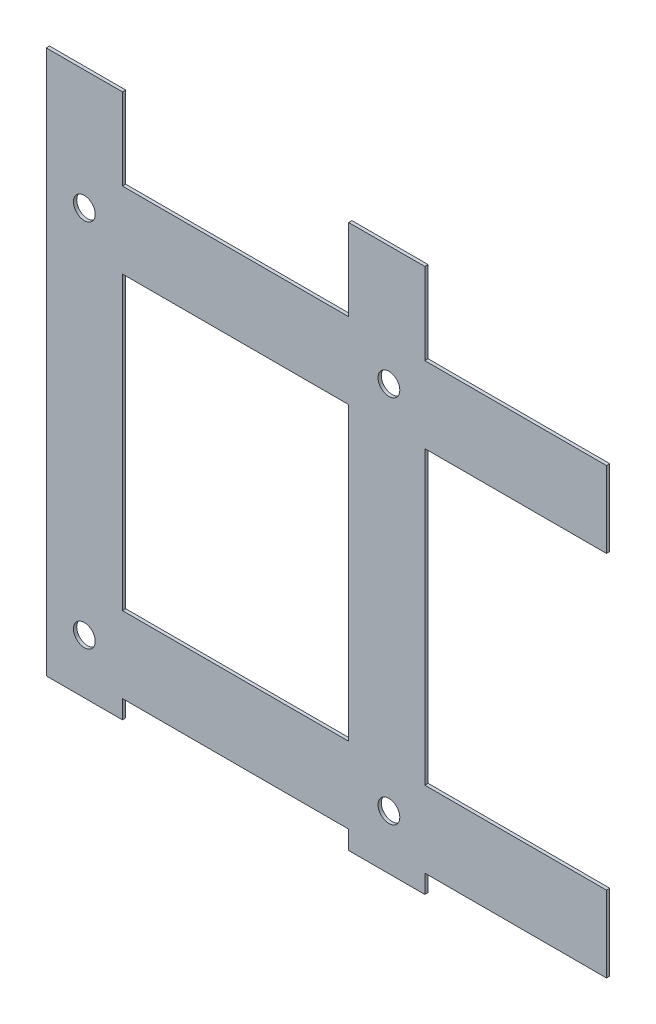
ISO-10303-21;
HEADER;
FILE_DESCRIPTION(('STEP AP214'),'2;1');
FILE_NAME('part.step','',(''),(''),'','','');
FILE_SCHEMA(('AUTOMOTIVE_DESIGN { 1 0 10303 214 1 1 1 1 }'));
ENDSEC;
DATA;
#1=APPLICATION_CONTEXT('core data for automotive mechanical design processes');
#2=APPLICATION_PROTOCOL_DEFINITION('international standard','automotive_design',2000,#1);
#3=PRODUCT_CONTEXT('',#1,'mechanical');
#4=PRODUCT('Part','Part','',(#3));
#5=PRODUCT_RELATED_PRODUCT_CATEGORY('part','',(#4));
#6=PRODUCT_DEFINITION_FORMATION('','',#4);
#7=PRODUCT_DEFINITION_CONTEXT('part definition',#1,'design');
#8=PRODUCT_DEFINITION('design','',#6,#7);
#9=PRODUCT_DEFINITION_SHAPE('','',#8);
#10=(LENGTH_UNIT() NAMED_UNIT(*) SI_UNIT(.MILLI.,.METRE.));
#11=(NAMED_UNIT(*) PLANE_ANGLE_UNIT() SI_UNIT($,.RADIAN.));
#12=(NAMED_UNIT(*) SI_UNIT($,.STERADIAN.) SOLID_ANGLE_UNIT());
#13=UNCERTAINTY_MEASURE_WITH_UNIT(LENGTH_MEASURE(1.E-05),#10,'distance_accuracy_value','');
#14=(GEOMETRIC_REPRESENTATION_CONTEXT(3) GLOBAL_UNCERTAINTY_ASSIGNED_CONTEXT((#13)) GLOBAL_UNIT_ASSIGNED_CONTEXT((#10,
#11,#12)) REPRESENTATION_CONTEXT('',''));
#15=CARTESIAN_POINT('',(0.,0.,0.));
#16=DIRECTION('',(0.,0.,1.));
#17=DIRECTION('',(1.,0.,0.));
#18=AXIS2_PLACEMENT_3D('',#15,#16,#17);
#19=CARTESIAN_POINT('',(-57.3540133748365,28.7716502738454,-3.));
#20=DIRECTION('',(0.,1.,0.));
#21=DIRECTION('',(0.,0.,1.));
#22=AXIS2_PLACEMENT_3D('',#19,#20,#21);
#23=PLANE('',#22);
#24=DIRECTION('',(-1.,0.,0.));
#25=VECTOR('',#24,1.);
#26=CARTESIAN_POINT('',(-57.3540133748365,28.7716502738454,0.));
#27=LINE('',#26,#25);
#28=CARTESIAN_POINT('',(12.6459866251635,28.7716502738454,0.));
#29=VERTEX_POINT('',#28);
#30=CARTESIAN_POINT('',(-57.3540133748365,28.7716502738454,0.));
#31=VERTEX_POINT('',#30);
#32=EDGE_CURVE('E239',#29,#31,#27,.T.);
#33=ORIENTED_EDGE('',*,*,#32,.F.);
#34=DIRECTION('',(0.,0.,1.));
#35=VECTOR('',#34,1.);
#36=CARTESIAN_POINT('',(12.6459866251635,28.7716502738454,-3.));
#37=LINE('',#36,#35);
#38=CARTESIAN_POINT('',(12.6459866251635,28.7716502738454,-3.));
#39=VERTEX_POINT('',#38);
#40=EDGE_CURVE('E11',#39,#29,#37,.T.);
#41=ORIENTED_EDGE('',*,*,#40,.F.);
#42=DIRECTION('',(-1.,0.,0.));
#43=VECTOR('',#42,1.);
#44=CARTESIAN_POINT('',(-57.3540133748365,28.7716502738454,-3.));
#45=LINE('',#44,#43);
#46=CARTESIAN_POINT('',(-57.3540133748365,28.7716502738454,-3.));
#47=VERTEX_POINT('',#46);
#48=EDGE_CURVE('E243',#39,#47,#45,.T.);
#49=ORIENTED_EDGE('',*,*,#48,.T.);
#50=DIRECTION('',(0.,0.,1.));
#51=VECTOR('',#50,1.);
#52=CARTESIAN_POINT('',(-57.3540133748365,28.7716502738454,-3.));
#53=LINE('',#52,#51);
#54=EDGE_CURVE('E44',#47,#31,#53,.T.);
#55=ORIENTED_EDGE('',*,*,#54,.T.);
#56=EDGE_LOOP('',(#33,#41,#49,#55));
#57=FACE_BOUND('',#56,.T.);
#58=ADVANCED_FACE('F41',(#57),#23,.T.);
#59=CARTESIAN_POINT('',(12.6459866251635,28.7716502738454,-3.));
#60=DIRECTION('',(1.,0.,0.));
#61=DIRECTION('',(0.,0.,-1.));
#62=AXIS2_PLACEMENT_3D('',#59,#60,#61);
#63=PLANE('',#62);
#64=DIRECTION('',(0.,1.,0.));
#65=VECTOR('',#64,1.);
#66=CARTESIAN_POINT('',(12.6459866251635,28.7716502738454,0.));
#67=LINE('',#66,#65);
#68=CARTESIAN_POINT('',(12.6459866251635,-46.2283497261546,0.));
#69=VERTEX_POINT('',#68);
#70=EDGE_CURVE('E247',#69,#29,#67,.T.);
#71=ORIENTED_EDGE('',*,*,#70,.F.);
#72=DIRECTION('',(0.,0.,1.));
#73=VECTOR('',#72,1.);
#74=CARTESIAN_POINT('',(12.6459866251635,-46.2283497261546,-3.));
#75=LINE('',#74,#73);
#76=CARTESIAN_POINT('',(12.6459866251635,-46.2283497261546,-3.));
#77=VERTEX_POINT('',#76);
#78=EDGE_CURVE('E49',#77,#69,#75,.T.);
#79=ORIENTED_EDGE('',*,*,#78,.F.);
#80=DIRECTION('',(0.,1.,0.));
#81=VECTOR('',#80,1.);
#82=CARTESIAN_POINT('',(12.6459866251635,28.7716502738454,-3.));
#83=LINE('',#82,#81);
#84=EDGE_CURVE('E301',#77,#39,#83,.T.);
#85=ORIENTED_EDGE('',*,*,#84,.T.);
#86=ORIENTED_EDGE('',*,*,#40,.T.);
#87=EDGE_LOOP('',(#71,#79,#85,#86));
#88=FACE_BOUND('',#87,.T.);
#89=ADVANCED_FACE('F408',(#88),#63,.T.);
#90=CARTESIAN_POINT('',(12.6459866251635,-46.2283497261546,-3.));
#91=DIRECTION('',(0.,1.,0.));
#92=DIRECTION('',(-1.,0.,0.));
#93=AXIS2_PLACEMENT_3D('',#90,#91,#92);
#94=PLANE('',#93);
#95=DIRECTION('',(-1.,0.,0.));
#96=VECTOR('',#95,1.);
#97=CARTESIAN_POINT('',(12.6459866251635,-46.2283497261546,0.));
#98=LINE('',#97,#96);
#99=CARTESIAN_POINT('',(220.645986625163,-46.2283497261546,0.));
#100=VERTEX_POINT('',#99);
#101=EDGE_CURVE('E357',#100,#69,#98,.T.);
#102=ORIENTED_EDGE('',*,*,#101,.F.);
#103=DIRECTION('',(0.,0.,1.));
#104=VECTOR('',#103,1.);
#105=CARTESIAN_POINT('',(220.645986625163,-46.2283497261546,-3.));
#106=LINE('',#105,#104);
#107=CARTESIAN_POINT('',(220.645986625163,-46.2283497261546,-3.));
#108=VERTEX_POINT('',#107);
#109=EDGE_CURVE('E363',#108,#100,#106,.T.);
#110=ORIENTED_EDGE('',*,*,#109,.F.);
#111=DIRECTION('',(-1.,0.,0.));
#112=VECTOR('',#111,1.);
#113=CARTESIAN_POINT('',(12.6459866251635,-46.2283497261546,-3.));
#114=LINE('',#113,#112);
#115=EDGE_CURVE('E298',#108,#77,#114,.T.);
#116=ORIENTED_EDGE('',*,*,#115,.T.);
#117=ORIENTED_EDGE('',*,*,#78,.T.);
#118=EDGE_LOOP('',(#102,#110,#116,#117));
#119=FACE_BOUND('',#118,.T.);
#120=ADVANCED_FACE('F475',(#119),#94,.T.);
#121=CARTESIAN_POINT('',(220.645986625163,28.7716502738454,-3.));
#122=DIRECTION('',(-1.,0.,0.));
#123=DIRECTION('',(0.,0.,1.));
#124=AXIS2_PLACEMENT_3D('',#121,#122,#123);
#125=PLANE('',#124);
#126=DIRECTION('',(0.,-1.,0.));
#127=VECTOR('',#126,1.);
#128=CARTESIAN_POINT('',(220.645986625163,28.7716502738454,0.));
#129=LINE('',#128,#127);
#130=CARTESIAN_POINT('',(220.645986625163,28.7716502738454,0.));
#131=VERTEX_POINT('',#130);
#132=EDGE_CURVE('E354',#131,#100,#129,.T.);
#133=ORIENTED_EDGE('',*,*,#132,.F.);
#134=DIRECTION('',(0.,0.,1.));
#135=VECTOR('',#134,1.);
#136=CARTESIAN_POINT('',(220.645986625163,28.7716502738454,-3.));
#137=LINE('',#136,#135);
#138=CARTESIAN_POINT('',(220.645986625163,28.7716502738454,-3.));
#139=VERTEX_POINT('',#138);
#140=EDGE_CURVE('E365',#139,#131,#137,.T.);
#141=ORIENTED_EDGE('',*,*,#140,.F.);
#142=DIRECTION('',(0.,-1.,0.));
#143=VECTOR('',#142,1.);
#144=CARTESIAN_POINT('',(220.645986625163,28.7716502738454,-3.));
#145=LINE('',#144,#143);
#146=EDGE_CURVE('E295',#139,#108,#145,.T.);
#147=ORIENTED_EDGE('',*,*,#146,.T.);
#148=ORIENTED_EDGE('',*,*,#109,.T.);
#149=EDGE_LOOP('',(#133,#141,#147,#148));
#150=FACE_BOUND('',#149,.T.);
#151=ADVANCED_FACE('F473',(#150),#125,.T.);
#152=CARTESIAN_POINT('',(220.645986625163,28.7716502738454,-3.));
#153=DIRECTION('',(0.,1.,0.));
#154=DIRECTION('',(-1.,0.,0.));
#155=AXIS2_PLACEMENT_3D('',#152,#153,#154);
#156=PLANE('',#155);
#157=DIRECTION('',(-1.,0.,0.));
#158=VECTOR('',#157,1.);
#159=CARTESIAN_POINT('',(220.645986625163,28.7716502738454,0.));
#160=LINE('',#159,#158);
#161=CARTESIAN_POINT('',(290.645986625163,28.7716502738454,0.));
#162=VERTEX_POINT('',#161);
#163=EDGE_CURVE('E351',#162,#131,#160,.T.);
#164=ORIENTED_EDGE('',*,*,#163,.F.);
#165=DIRECTION('',(0.,0.,1.));
#166=VECTOR('',#165,1.);
#167=CARTESIAN_POINT('',(290.645986625163,28.7716502738454,-3.));
#168=LINE('',#167,#166);
#169=CARTESIAN_POINT('',(290.645986625163,28.7716502738454,-3.));
#170=VERTEX_POINT('',#169);
#171=EDGE_CURVE('E367',#170,#162,#168,.T.);
#172=ORIENTED_EDGE('',*,*,#171,.F.);
#173=DIRECTION('',(-1.,0.,0.));
#174=VECTOR('',#173,1.);
#175=CARTESIAN_POINT('',(220.645986625163,28.7716502738454,-3.));
#176=LINE('',#175,#174);
#177=EDGE_CURVE('E292',#170,#139,#176,.T.);
#178=ORIENTED_EDGE('',*,*,#177,.T.);
#179=ORIENTED_EDGE('',*,*,#140,.T.);
#180=EDGE_LOOP('',(#164,#172,#178,#179));
#181=FACE_BOUND('',#180,.T.);
#182=ADVANCED_FACE('F469',(#181),#156,.T.);
#183=CARTESIAN_POINT('',(290.645986625163,28.7716502738454,-3.));
#184=DIRECTION('',(1.,0.,0.));
#185=DIRECTION('',(0.,0.,-1.));
#186=AXIS2_PLACEMENT_3D('',#183,#184,#185);
#187=PLANE('',#186);
#188=DIRECTION('',(0.,1.,0.));
#189=VECTOR('',#188,1.);
#190=CARTESIAN_POINT('',(290.645986625163,28.7716502738454,0.));
#191=LINE('',#190,#189);
#192=CARTESIAN_POINT('',(290.645986625163,-46.2283497261546,0.));
#193=VERTEX_POINT('',#192);
#194=EDGE_CURVE('E348',#193,#162,#191,.T.);
#195=ORIENTED_EDGE('',*,*,#194,.F.);
#196=DIRECTION('',(0.,0.,1.));
#197=VECTOR('',#196,1.);
#198=CARTESIAN_POINT('',(290.645986625163,-46.2283497261546,-3.));
#199=LINE('',#198,#197);
#200=CARTESIAN_POINT('',(290.645986625163,-46.2283497261546,-3.));
#201=VERTEX_POINT('',#200);
#202=EDGE_CURVE('E369',#201,#193,#199,.T.);
#203=ORIENTED_EDGE('',*,*,#202,.F.);
#204=DIRECTION('',(0.,1.,0.));
#205=VECTOR('',#204,1.);
#206=CARTESIAN_POINT('',(290.645986625163,28.7716502738454,-3.));
#207=LINE('',#206,#205);
#208=EDGE_CURVE('E289',#201,#170,#207,.T.);
#209=ORIENTED_EDGE('',*,*,#208,.T.);
#210=ORIENTED_EDGE('',*,*,#171,.T.);
#211=EDGE_LOOP('',(#195,#203,#209,#210));
#212=FACE_BOUND('',#211,.T.);
#213=ADVANCED_FACE('F465',(#212),#187,.T.);
#214=CARTESIAN_POINT('',(290.645986625163,-46.2283497261546,-3.));
#215=DIRECTION('',(0.,1.,0.));
#216=DIRECTION('',(0.,0.,1.));
#217=AXIS2_PLACEMENT_3D('',#214,#215,#216);
#218=PLANE('',#217);
#219=DIRECTION('',(-1.,0.,0.));
#220=VECTOR('',#219,1.);
#221=CARTESIAN_POINT('',(290.645986625163,-46.2283497261546,0.));
#222=LINE('',#221,#220);
#223=CARTESIAN_POINT('',(457.645986625163,-46.2283497261546,0.));
#224=VERTEX_POINT('',#223);
#225=EDGE_CURVE('E345',#224,#193,#222,.T.);
#226=ORIENTED_EDGE('',*,*,#225,.F.);
#227=DIRECTION('',(0.,0.,1.));
#228=VECTOR('',#227,1.);
#229=CARTESIAN_POINT('',(457.645986625163,-46.2283497261546,-3.));
#230=LINE('',#229,#228);
#231=CARTESIAN_POINT('',(457.645986625163,-46.2283497261546,-3.));
#232=VERTEX_POINT('',#231);
#233=EDGE_CURVE('E371',#232,#224,#230,.T.);
#234=ORIENTED_EDGE('',*,*,#233,.F.);
#235=DIRECTION('',(-1.,0.,0.));
#236=VECTOR('',#235,1.);
#237=CARTESIAN_POINT('',(290.645986625163,-46.2283497261546,-3.));
#238=LINE('',#237,#236);
#239=EDGE_CURVE('E286',#232,#201,#238,.T.);
#240=ORIENTED_EDGE('',*,*,#239,.T.);
#241=ORIENTED_EDGE('',*,*,#202,.T.);
#242=EDGE_LOOP('',(#226,#234,#240,#241));
#243=FACE_BOUND('',#242,.T.);
#244=ADVANCED_FACE('F461',(#243),#218,.T.);
#245=CARTESIAN_POINT('',(457.645986625163,-46.2283497261546,-3.));
#246=DIRECTION('',(1.,0.,0.));
#247=DIRECTION('',(0.,0.,-1.));
#248=AXIS2_PLACEMENT_3D('',#245,#246,#247);
#249=PLANE('',#248);
#250=DIRECTION('',(0.,1.,0.));
#251=VECTOR('',#250,1.);
#252=CARTESIAN_POINT('',(457.645986625163,-46.2283497261546,0.));
#253=LINE('',#252,#251);
#254=CARTESIAN_POINT('',(457.645986625163,-116.228349726155,0.));
#255=VERTEX_POINT('',#254);
#256=EDGE_CURVE('E342',#255,#224,#253,.T.);
#257=ORIENTED_EDGE('',*,*,#256,.F.);
#258=DIRECTION('',(0.,0.,1.));
#259=VECTOR('',#258,1.);
#260=CARTESIAN_POINT('',(457.645986625163,-116.228349726155,-3.));
#261=LINE('',#260,#259);
#262=CARTESIAN_POINT('',(457.645986625163,-116.228349726155,-3.));
#263=VERTEX_POINT('',#262);
#264=EDGE_CURVE('E373',#263,#255,#261,.T.);
#265=ORIENTED_EDGE('',*,*,#264,.F.);
#266=DIRECTION('',(0.,1.,0.));
#267=VECTOR('',#266,1.);
#268=CARTESIAN_POINT('',(457.645986625163,-46.2283497261546,-3.));
#269=LINE('',#268,#267);
#270=EDGE_CURVE('E283',#263,#232,#269,.T.);
#271=ORIENTED_EDGE('',*,*,#270,.T.);
#272=ORIENTED_EDGE('',*,*,#233,.T.);
#273=EDGE_LOOP('',(#257,#265,#271,#272));
#274=FACE_BOUND('',#273,.T.);
#275=ADVANCED_FACE('F457',(#274),#249,.T.);
#276=CARTESIAN_POINT('',(290.645986625163,-116.228349726155,-3.));
#277=DIRECTION('',(0.,-1.,0.));
#278=DIRECTION('',(0.,0.,-1.));
#279=AXIS2_PLACEMENT_3D('',#276,#277,#278);
#280=PLANE('',#279);
#281=DIRECTION('',(1.,0.,0.));
#282=VECTOR('',#281,1.);
#283=CARTESIAN_POINT('',(290.645986625163,-116.228349726155,0.));
#284=LINE('',#283,#282);
#285=CARTESIAN_POINT('',(290.645986625163,-116.228349726155,0.));
#286=VERTEX_POINT('',#285);
#287=EDGE_CURVE('E339',#286,#255,#284,.T.);
#288=ORIENTED_EDGE('',*,*,#287,.F.);
#289=DIRECTION('',(0.,0.,1.));
#290=VECTOR('',#289,1.);
#291=CARTESIAN_POINT('',(290.645986625163,-116.228349726155,-3.));
#292=LINE('',#291,#290);
#293=CARTESIAN_POINT('',(290.645986625163,-116.228349726155,-3.));
#294=VERTEX_POINT('',#293);
#295=EDGE_CURVE('E375',#294,#286,#292,.T.);
#296=ORIENTED_EDGE('',*,*,#295,.F.);
#297=DIRECTION('',(1.,0.,0.));
#298=VECTOR('',#297,1.);
#299=CARTESIAN_POINT('',(290.645986625163,-116.228349726155,-3.));
#300=LINE('',#299,#298);
#301=EDGE_CURVE('E280',#294,#263,#300,.T.);
#302=ORIENTED_EDGE('',*,*,#301,.T.);
#303=ORIENTED_EDGE('',*,*,#264,.T.);
#304=EDGE_LOOP('',(#288,#296,#302,#303));
#305=FACE_BOUND('',#304,.T.);
#306=ADVANCED_FACE('F453',(#305),#280,.T.);
#307=CARTESIAN_POINT('',(290.645986625163,-116.228349726155,-3.));
#308=DIRECTION('',(1.,0.,0.));
#309=DIRECTION('',(0.,1.,0.));
#310=AXIS2_PLACEMENT_3D('',#307,#308,#309);
#311=PLANE('',#310);
#312=DIRECTION('',(0.,1.,0.));
#313=VECTOR('',#312,1.);
#314=CARTESIAN_POINT('',(290.645986625163,-116.228349726155,0.));
#315=LINE('',#314,#313);
#316=CARTESIAN_POINT('',(290.645986625163,-384.228349726155,0.));
#317=VERTEX_POINT('',#316);
#318=EDGE_CURVE('E336',#317,#286,#315,.T.);
#319=ORIENTED_EDGE('',*,*,#318,.F.);
#320=DIRECTION('',(0.,0.,1.));
#321=VECTOR('',#320,1.);
#322=CARTESIAN_POINT('',(290.645986625163,-384.228349726155,-3.));
#323=LINE('',#322,#321);
#324=CARTESIAN_POINT('',(290.645986625163,-384.228349726155,-3.));
#325=VERTEX_POINT('',#324);
#326=EDGE_CURVE('E377',#325,#317,#323,.T.);
#327=ORIENTED_EDGE('',*,*,#326,.F.);
#328=DIRECTION('',(0.,1.,0.));
#329=VECTOR('',#328,1.);
#330=CARTESIAN_POINT('',(290.645986625163,-116.228349726155,-3.));
#331=LINE('',#330,#329);
#332=EDGE_CURVE('E277',#325,#294,#331,.T.);
#333=ORIENTED_EDGE('',*,*,#332,.T.);
#334=ORIENTED_EDGE('',*,*,#295,.T.);
#335=EDGE_LOOP('',(#319,#327,#333,#334));
#336=FACE_BOUND('',#335,.T.);
#337=ADVANCED_FACE('F449',(#336),#311,.T.);
#338=CARTESIAN_POINT('',(290.645986625163,-384.228349726155,-3.));
#339=DIRECTION('',(0.,1.,0.));
#340=DIRECTION('',(0.,0.,1.));
#341=AXIS2_PLACEMENT_3D('',#338,#339,#340);
#342=PLANE('',#341);
#343=DIRECTION('',(-1.,0.,0.));
#344=VECTOR('',#343,1.);
#345=CARTESIAN_POINT('',(290.645986625163,-384.228349726155,0.));
#346=LINE('',#345,#344);
#347=CARTESIAN_POINT('',(457.645986625163,-384.228349726155,0.));
#348=VERTEX_POINT('',#347);
#349=EDGE_CURVE('E333',#348,#317,#346,.T.);
#350=ORIENTED_EDGE('',*,*,#349,.F.);
#351=DIRECTION('',(0.,0.,1.));
#352=VECTOR('',#351,1.);
#353=CARTESIAN_POINT('',(457.645986625163,-384.228349726155,-3.));
#354=LINE('',#353,#352);
#355=CARTESIAN_POINT('',(457.645986625163,-384.228349726155,-3.));
#356=VERTEX_POINT('',#355);
#357=EDGE_CURVE('E379',#356,#348,#354,.T.);
#358=ORIENTED_EDGE('',*,*,#357,.F.);
#359=DIRECTION('',(-1.,0.,0.));
#360=VECTOR('',#359,1.);
#361=CARTESIAN_POINT('',(290.645986625163,-384.228349726155,-3.));
#362=LINE('',#361,#360);
#363=EDGE_CURVE('E274',#356,#325,#362,.T.);
#364=ORIENTED_EDGE('',*,*,#363,.T.);
#365=ORIENTED_EDGE('',*,*,#326,.T.);
#366=EDGE_LOOP('',(#350,#358,#364,#365));
#367=FACE_BOUND('',#366,.T.);
#368=ADVANCED_FACE('F445',(#367),#342,.T.);
#369=CARTESIAN_POINT('',(457.645986625163,-384.228349726155,-3.));
#370=DIRECTION('',(1.,0.,0.));
#371=DIRECTION('',(0.,0.,-1.));
#372=AXIS2_PLACEMENT_3D('',#369,#370,#371);
#373=PLANE('',#372);
#374=DIRECTION('',(0.,1.,0.));
#375=VECTOR('',#374,1.);
#376=CARTESIAN_POINT('',(457.645986625163,-384.228349726155,0.));
#377=LINE('',#376,#375);
#378=CARTESIAN_POINT('',(457.645986625163,-454.228349726155,0.));
#379=VERTEX_POINT('',#378);
#380=EDGE_CURVE('E330',#379,#348,#377,.T.);
#381=ORIENTED_EDGE('',*,*,#380,.F.);
#382=DIRECTION('',(0.,0.,1.));
#383=VECTOR('',#382,1.);
#384=CARTESIAN_POINT('',(457.645986625163,-454.228349726155,-3.));
#385=LINE('',#384,#383);
#386=CARTESIAN_POINT('',(457.645986625163,-454.228349726155,-3.));
#387=VERTEX_POINT('',#386);
#388=EDGE_CURVE('E381',#387,#379,#385,.T.);
#389=ORIENTED_EDGE('',*,*,#388,.F.);
#390=DIRECTION('',(0.,1.,0.));
#391=VECTOR('',#390,1.);
#392=CARTESIAN_POINT('',(457.645986625163,-384.228349726155,-3.));
#393=LINE('',#392,#391);
#394=EDGE_CURVE('E271',#387,#356,#393,.T.);
#395=ORIENTED_EDGE('',*,*,#394,.T.);
#396=ORIENTED_EDGE('',*,*,#357,.T.);
#397=EDGE_LOOP('',(#381,#389,#395,#396));
#398=FACE_BOUND('',#397,.T.);
#399=ADVANCED_FACE('F441',(#398),#373,.T.);
#400=CARTESIAN_POINT('',(290.645986625163,-454.228349726155,-3.));
#401=DIRECTION('',(0.,-1.,0.));
#402=DIRECTION('',(1.,0.,0.));
#403=AXIS2_PLACEMENT_3D('',#400,#401,#402);
#404=PLANE('',#403);
#405=DIRECTION('',(1.,0.,0.));
#406=VECTOR('',#405,1.);
#407=CARTESIAN_POINT('',(290.645986625163,-454.228349726155,0.));
#408=LINE('',#407,#406);
#409=CARTESIAN_POINT('',(290.645986625163,-454.228349726155,0.));
#410=VERTEX_POINT('',#409);
#411=EDGE_CURVE('E327',#410,#379,#408,.T.);
#412=ORIENTED_EDGE('',*,*,#411,.F.);
#413=DIRECTION('',(0.,0.,1.));
#414=VECTOR('',#413,1.);
#415=CARTESIAN_POINT('',(290.645986625163,-454.228349726155,-3.));
#416=LINE('',#415,#414);
#417=CARTESIAN_POINT('',(290.645986625163,-454.228349726155,-3.));
#418=VERTEX_POINT('',#417);
#419=EDGE_CURVE('E383',#418,#410,#416,.T.);
#420=ORIENTED_EDGE('',*,*,#419,.F.);
#421=DIRECTION('',(1.,0.,0.));
#422=VECTOR('',#421,1.);
#423=CARTESIAN_POINT('',(290.645986625163,-454.228349726155,-3.));
#424=LINE('',#423,#422);
#425=EDGE_CURVE('E268',#418,#387,#424,.T.);
#426=ORIENTED_EDGE('',*,*,#425,.T.);
#427=ORIENTED_EDGE('',*,*,#388,.T.);
#428=EDGE_LOOP('',(#412,#420,#426,#427));
#429=FACE_BOUND('',#428,.T.);
#430=ADVANCED_FACE('F437',(#429),#404,.T.);
#431=CARTESIAN_POINT('',(290.645986625163,-454.228349726155,-3.));
#432=DIRECTION('',(1.,0.,0.));
#433=DIRECTION('',(0.,0.,-1.));
#434=AXIS2_PLACEMENT_3D('',#431,#432,#433);
#435=PLANE('',#434);
#436=DIRECTION('',(0.,1.,0.));
#437=VECTOR('',#436,1.);
#438=CARTESIAN_POINT('',(290.645986625163,-454.228349726155,0.));
#439=LINE('',#438,#437);
#440=CARTESIAN_POINT('',(290.645986625163,-471.228349726155,0.));
#441=VERTEX_POINT('',#440);
#442=EDGE_CURVE('E324',#441,#410,#439,.T.);
#443=ORIENTED_EDGE('',*,*,#442,.F.);
#444=DIRECTION('',(0.,0.,1.));
#445=VECTOR('',#444,1.);
#446=CARTESIAN_POINT('',(290.645986625163,-471.228349726155,-3.));
#447=LINE('',#446,#445);
#448=CARTESIAN_POINT('',(290.645986625163,-471.228349726155,-3.));
#449=VERTEX_POINT('',#448);
#450=EDGE_CURVE('E385',#449,#441,#447,.T.);
#451=ORIENTED_EDGE('',*,*,#450,.F.);
#452=DIRECTION('',(0.,1.,0.));
#453=VECTOR('',#452,1.);
#454=CARTESIAN_POINT('',(290.645986625163,-454.228349726155,-3.));
#455=LINE('',#454,#453);
#456=EDGE_CURVE('E265',#449,#418,#455,.T.);
#457=ORIENTED_EDGE('',*,*,#456,.T.);
#458=ORIENTED_EDGE('',*,*,#419,.T.);
#459=EDGE_LOOP('',(#443,#451,#457,#458));
#460=FACE_BOUND('',#459,.T.);
#461=ADVANCED_FACE('F433',(#460),#435,.T.);
#462=CARTESIAN_POINT('',(220.645986625163,-471.228349726155,-3.));
#463=DIRECTION('',(0.,-1.,0.));
#464=DIRECTION('',(0.,0.,-1.));
#465=AXIS2_PLACEMENT_3D('',#462,#463,#464);
#466=PLANE('',#465);
#467=DIRECTION('',(1.,0.,0.));
#468=VECTOR('',#467,1.);
#469=CARTESIAN_POINT('',(220.645986625163,-471.228349726155,0.));
#470=LINE('',#469,#468);
#471=CARTESIAN_POINT('',(220.645986625163,-471.228349726155,0.));
#472=VERTEX_POINT('',#471);
#473=EDGE_CURVE('E321',#472,#441,#470,.T.);
#474=ORIENTED_EDGE('',*,*,#473,.F.);
#475=DIRECTION('',(0.,0.,1.));
#476=VECTOR('',#475,1.);
#477=CARTESIAN_POINT('',(220.645986625163,-471.228349726155,-3.));
#478=LINE('',#477,#476);
#479=CARTESIAN_POINT('',(220.645986625163,-471.228349726155,-3.));
#480=VERTEX_POINT('',#479);
#481=EDGE_CURVE('E387',#480,#472,#478,.T.);
#482=ORIENTED_EDGE('',*,*,#481,.F.);
#483=DIRECTION('',(1.,0.,0.));
#484=VECTOR('',#483,1.);
#485=CARTESIAN_POINT('',(220.645986625163,-471.228349726155,-3.));
#486=LINE('',#485,#484);
#487=EDGE_CURVE('E262',#480,#449,#486,.T.);
#488=ORIENTED_EDGE('',*,*,#487,.T.);
#489=ORIENTED_EDGE('',*,*,#450,.T.);
#490=EDGE_LOOP('',(#474,#482,#488,#489));
#491=FACE_BOUND('',#490,.T.);
#492=ADVANCED_FACE('F429',(#491),#466,.T.);
#493=CARTESIAN_POINT('',(220.645986625163,-454.228349726155,-3.));
#494=DIRECTION('',(-1.,0.,0.));
#495=DIRECTION('',(0.,0.,1.));
#496=AXIS2_PLACEMENT_3D('',#493,#494,#495);
#497=PLANE('',#496);
#498=DIRECTION('',(0.,-1.,0.));
#499=VECTOR('',#498,1.);
#500=CARTESIAN_POINT('',(220.645986625163,-454.228349726155,0.));
#501=LINE('',#500,#499);
#502=CARTESIAN_POINT('',(220.645986625163,-454.228349726155,0.));
#503=VERTEX_POINT('',#502);
#504=EDGE_CURVE('E318',#503,#472,#501,.T.);
#505=ORIENTED_EDGE('',*,*,#504,.F.);
#506=DIRECTION('',(0.,0.,1.));
#507=VECTOR('',#506,1.);
#508=CARTESIAN_POINT('',(220.645986625163,-454.228349726155,-3.));
#509=LINE('',#508,#507);
#510=CARTESIAN_POINT('',(220.645986625163,-454.228349726155,-3.));
#511=VERTEX_POINT('',#510);
#512=EDGE_CURVE('E389',#511,#503,#509,.T.);
#513=ORIENTED_EDGE('',*,*,#512,.F.);
#514=DIRECTION('',(0.,-1.,0.));
#515=VECTOR('',#514,1.);
#516=CARTESIAN_POINT('',(220.645986625163,-454.228349726155,-3.));
#517=LINE('',#516,#515);
#518=EDGE_CURVE('E259',#511,#480,#517,.T.);
#519=ORIENTED_EDGE('',*,*,#518,.T.);
#520=ORIENTED_EDGE('',*,*,#481,.T.);
#521=EDGE_LOOP('',(#505,#513,#519,#520));
#522=FACE_BOUND('',#521,.T.);
#523=ADVANCED_FACE('F425',(#522),#497,.T.);
#524=CARTESIAN_POINT('',(12.6459866251635,-454.228349726155,-3.));
#525=DIRECTION('',(0.,-1.,0.));
#526=DIRECTION('',(1.,0.,0.));
#527=AXIS2_PLACEMENT_3D('',#524,#525,#526);
#528=PLANE('',#527);
#529=DIRECTION('',(1.,0.,0.));
#530=VECTOR('',#529,1.);
#531=CARTESIAN_POINT('',(12.6459866251635,-454.228349726155,0.));
#532=LINE('',#531,#530);
#533=CARTESIAN_POINT('',(12.6459866251635,-454.228349726155,0.));
#534=VERTEX_POINT('',#533);
#535=EDGE_CURVE('E315',#534,#503,#532,.T.);
#536=ORIENTED_EDGE('',*,*,#535,.F.);
#537=DIRECTION('',(0.,0.,1.));
#538=VECTOR('',#537,1.);
#539=CARTESIAN_POINT('',(12.6459866251635,-454.228349726155,-3.));
#540=LINE('',#539,#538);
#541=CARTESIAN_POINT('',(12.6459866251635,-454.228349726155,-3.));
#542=VERTEX_POINT('',#541);
#543=EDGE_CURVE('E391',#542,#534,#540,.T.);
#544=ORIENTED_EDGE('',*,*,#543,.F.);
#545=DIRECTION('',(1.,0.,0.));
#546=VECTOR('',#545,1.);
#547=CARTESIAN_POINT('',(12.6459866251635,-454.228349726155,-3.));
#548=LINE('',#547,#546);
#549=EDGE_CURVE('E256',#542,#511,#548,.T.);
#550=ORIENTED_EDGE('',*,*,#549,.T.);
#551=ORIENTED_EDGE('',*,*,#512,.T.);
#552=EDGE_LOOP('',(#536,#544,#550,#551));
#553=FACE_BOUND('',#552,.T.);
#554=ADVANCED_FACE('F421',(#553),#528,.T.);
#555=CARTESIAN_POINT('',(12.6459866251635,-454.228349726155,-3.));
#556=DIRECTION('',(1.,0.,0.));
#557=DIRECTION('',(0.,0.,-1.));
#558=AXIS2_PLACEMENT_3D('',#555,#556,#557);
#559=PLANE('',#558);
#560=DIRECTION('',(0.,1.,0.));
#561=VECTOR('',#560,1.);
#562=CARTESIAN_POINT('',(12.6459866251635,-454.228349726155,0.));
#563=LINE('',#562,#561);
#564=CARTESIAN_POINT('',(12.6459866251635,-471.228349726155,0.));
#565=VERTEX_POINT('',#564);
#566=EDGE_CURVE('E312',#565,#534,#563,.T.);
#567=ORIENTED_EDGE('',*,*,#566,.F.);
#568=DIRECTION('',(0.,0.,1.));
#569=VECTOR('',#568,1.);
#570=CARTESIAN_POINT('',(12.6459866251635,-471.228349726155,-3.));
#571=LINE('',#570,#569);
#572=CARTESIAN_POINT('',(12.6459866251635,-471.228349726155,-3.));
#573=VERTEX_POINT('',#572);
#574=EDGE_CURVE('E393',#573,#565,#571,.T.);
#575=ORIENTED_EDGE('',*,*,#574,.F.);
#576=DIRECTION('',(0.,1.,0.));
#577=VECTOR('',#576,1.);
#578=CARTESIAN_POINT('',(12.6459866251635,-454.228349726155,-3.));
#579=LINE('',#578,#577);
#580=EDGE_CURVE('E253',#573,#542,#579,.T.);
#581=ORIENTED_EDGE('',*,*,#580,.T.);
#582=ORIENTED_EDGE('',*,*,#543,.T.);
#583=EDGE_LOOP('',(#567,#575,#581,#582));
#584=FACE_BOUND('',#583,.T.);
#585=ADVANCED_FACE('F419',(#584),#559,.T.);
#586=CARTESIAN_POINT('',(-57.3540133748365,-471.228349726155,-3.));
#587=DIRECTION('',(0.,-1.,0.));
#588=DIRECTION('',(0.,0.,-1.));
#589=AXIS2_PLACEMENT_3D('',#586,#587,#588);
#590=PLANE('',#589);
#591=DIRECTION('',(1.,0.,0.));
#592=VECTOR('',#591,1.);
#593=CARTESIAN_POINT('',(-57.3540133748365,-471.228349726155,0.));
#594=LINE('',#593,#592);
#595=CARTESIAN_POINT('',(-57.3540133748365,-471.228349726155,0.));
#596=VERTEX_POINT('',#595);
#597=EDGE_CURVE('E309',#596,#565,#594,.T.);
#598=ORIENTED_EDGE('',*,*,#597,.F.);
#599=DIRECTION('',(0.,0.,1.));
#600=VECTOR('',#599,1.);
#601=CARTESIAN_POINT('',(-57.3540133748365,-471.228349726155,-3.));
#602=LINE('',#601,#600);
#603=CARTESIAN_POINT('',(-57.3540133748365,-471.228349726155,-3.));
#604=VERTEX_POINT('',#603);
#605=EDGE_CURVE('E394',#604,#596,#602,.T.);
#606=ORIENTED_EDGE('',*,*,#605,.F.);
#607=DIRECTION('',(1.,0.,0.));
#608=VECTOR('',#607,1.);
#609=CARTESIAN_POINT('',(-57.3540133748365,-471.228349726155,-3.));
#610=LINE('',#609,#608);
#611=EDGE_CURVE('E250',#604,#573,#610,.T.);
#612=ORIENTED_EDGE('',*,*,#611,.T.);
#613=ORIENTED_EDGE('',*,*,#574,.T.);
#614=EDGE_LOOP('',(#598,#606,#612,#613));
#615=FACE_BOUND('',#614,.T.);
#616=ADVANCED_FACE('F415',(#615),#590,.T.);
#617=CARTESIAN_POINT('',(-57.3540133748365,28.7716502738454,-3.));
#618=DIRECTION('',(-1.,0.,0.));
#619=DIRECTION('',(0.,0.,1.));
#620=AXIS2_PLACEMENT_3D('',#617,#618,#619);
#621=PLANE('',#620);
#622=DIRECTION('',(0.,-1.,0.));
#623=VECTOR('',#622,1.);
#624=CARTESIAN_POINT('',(-57.3540133748365,28.7716502738454,0.));
#625=LINE('',#624,#623);
#626=EDGE_CURVE('E306',#31,#596,#625,.T.);
#627=ORIENTED_EDGE('',*,*,#626,.F.);
#628=ORIENTED_EDGE('',*,*,#54,.F.);
#629=DIRECTION('',(0.,-1.,0.));
#630=VECTOR('',#629,1.);
#631=CARTESIAN_POINT('',(-57.3540133748365,28.7716502738454,-3.));
#632=LINE('',#631,#630);
#633=EDGE_CURVE('E246',#47,#604,#632,.T.);
#634=ORIENTED_EDGE('',*,*,#633,.T.);
#635=ORIENTED_EDGE('',*,*,#605,.T.);
#636=EDGE_LOOP('',(#627,#628,#634,#635));
#637=FACE_BOUND('',#636,.T.);
#638=ADVANCED_FACE('F402',(#637),#621,.T.);
#639=CARTESIAN_POINT('',(0.,0.,-3.));
#640=DIRECTION('',(0.,0.,-1.));
#641=DIRECTION('',(-1.,0.,0.));
#642=AXIS2_PLACEMENT_3D('',#639,#640,#641);
#643=PLANE('',#642);
#644=CARTESIAN_POINT('',(257.645986625163,-421.228349726155,-3.));
#645=DIRECTION('',(0.,0.,-1.));
#646=DIRECTION('',(-1.,0.,0.));
#647=AXIS2_PLACEMENT_3D('',#644,#645,#646);
#648=CIRCLE('',#647,10.);
#649=CARTESIAN_POINT('',(247.645986625163,-421.228349726155,-3.));
#650=VERTEX_POINT('',#649);
#651=EDGE_CURVE('E790',#650,#650,#648,.F.);
#652=ORIENTED_EDGE('',*,*,#651,.T.);
#653=EDGE_LOOP('',(#652));
#654=FACE_BOUND('',#653,.T.);
#655=CARTESIAN_POINT('',(-22.3540133748365,-421.228349726155,-3.));
#656=DIRECTION('',(0.,0.,-1.));
#657=DIRECTION('',(-1.,0.,0.));
#658=AXIS2_PLACEMENT_3D('',#655,#656,#657);
#659=CIRCLE('',#658,10.);
#660=CARTESIAN_POINT('',(-32.3540133748365,-421.228349726155,-3.));
#661=VERTEX_POINT('',#660);
#662=EDGE_CURVE('E794',#661,#661,#659,.F.);
#663=ORIENTED_EDGE('',*,*,#662,.T.);
#664=EDGE_LOOP('',(#663));
#665=FACE_BOUND('',#664,.T.);
#666=CARTESIAN_POINT('',(257.645986625163,-81.2283497261546,-3.));
#667=DIRECTION('',(0.,0.,-1.));
#668=DIRECTION('',(-1.,0.,0.));
#669=AXIS2_PLACEMENT_3D('',#666,#667,#668);
#670=CIRCLE('',#669,10.);
#671=CARTESIAN_POINT('',(247.645986625163,-81.2283497261546,-3.));
#672=VERTEX_POINT('',#671);
#673=EDGE_CURVE('E802',#672,#672,#670,.F.);
#674=ORIENTED_EDGE('',*,*,#673,.T.);
#675=EDGE_LOOP('',(#674));
#676=FACE_BOUND('',#675,.T.);
#677=CARTESIAN_POINT('',(-22.3540133748365,-81.2283497261546,-3.));
#678=DIRECTION('',(0.,0.,-1.));
#679=DIRECTION('',(-1.,0.,0.));
#680=AXIS2_PLACEMENT_3D('',#677,#678,#679);
#681=CIRCLE('',#680,10.);
#682=CARTESIAN_POINT('',(-32.3540133748365,-81.2283497261546,-3.));
#683=VERTEX_POINT('',#682);
#684=EDGE_CURVE('E226',#683,#683,#681,.F.);
#685=ORIENTED_EDGE('',*,*,#684,.T.);
#686=EDGE_LOOP('',(#685));
#687=FACE_BOUND('',#686,.T.);
#688=DIRECTION('',(0.,-1.,0.));
#689=VECTOR('',#688,1.);
#690=CARTESIAN_POINT('',(12.6459866251635,-116.228349726155,-3.));
#691=LINE('',#690,#689);
#692=CARTESIAN_POINT('',(12.6459866251635,-116.228349726155,-3.));
#693=VERTEX_POINT('',#692);
#694=CARTESIAN_POINT('',(12.6459866251635,-384.228349726155,-3.));
#695=VERTEX_POINT('',#694);
#696=EDGE_CURVE('E204',#693,#695,#691,.T.);
#697=ORIENTED_EDGE('',*,*,#696,.T.);
#698=DIRECTION('',(1.,0.,0.));
#699=VECTOR('',#698,1.);
#700=CARTESIAN_POINT('',(12.6459866251635,-384.228349726155,-3.));
#701=LINE('',#700,#699);
#702=CARTESIAN_POINT('',(220.645986625163,-384.228349726155,-3.));
#703=VERTEX_POINT('',#702);
#704=EDGE_CURVE('E213',#695,#703,#701,.T.);
#705=ORIENTED_EDGE('',*,*,#704,.T.);
#706=DIRECTION('',(0.,1.,0.));
#707=VECTOR('',#706,1.);
#708=CARTESIAN_POINT('',(220.645986625163,-116.228349726155,-3.));
#709=LINE('',#708,#707);
#710=CARTESIAN_POINT('',(220.645986625163,-116.228349726155,-3.));
#711=VERTEX_POINT('',#710);
#712=EDGE_CURVE('E57',#703,#711,#709,.T.);
#713=ORIENTED_EDGE('',*,*,#712,.T.);
#714=DIRECTION('',(-1.,0.,0.));
#715=VECTOR('',#714,1.);
#716=CARTESIAN_POINT('',(12.6459866251635,-116.228349726155,-3.));
#717=LINE('',#716,#715);
#718=EDGE_CURVE('E210',#711,#693,#717,.T.);
#719=ORIENTED_EDGE('',*,*,#718,.T.);
#720=EDGE_LOOP('',(#697,#705,#713,#719));
#721=FACE_BOUND('',#720,.T.);
#722=ORIENTED_EDGE('',*,*,#48,.F.);
#723=ORIENTED_EDGE('',*,*,#84,.F.);
#724=ORIENTED_EDGE('',*,*,#115,.F.);
#725=ORIENTED_EDGE('',*,*,#146,.F.);
#726=ORIENTED_EDGE('',*,*,#177,.F.);
#727=ORIENTED_EDGE('',*,*,#208,.F.);
#728=ORIENTED_EDGE('',*,*,#239,.F.);
#729=ORIENTED_EDGE('',*,*,#270,.F.);
#730=ORIENTED_EDGE('',*,*,#301,.F.);
#731=ORIENTED_EDGE('',*,*,#332,.F.);
#732=ORIENTED_EDGE('',*,*,#363,.F.);
#733=ORIENTED_EDGE('',*,*,#394,.F.);
#734=ORIENTED_EDGE('',*,*,#425,.F.);
#735=ORIENTED_EDGE('',*,*,#456,.F.);
#736=ORIENTED_EDGE('',*,*,#487,.F.);
#737=ORIENTED_EDGE('',*,*,#518,.F.);
#738=ORIENTED_EDGE('',*,*,#549,.F.);
#739=ORIENTED_EDGE('',*,*,#580,.F.);
#740=ORIENTED_EDGE('',*,*,#611,.F.);
#741=ORIENTED_EDGE('',*,*,#633,.F.);
#742=EDGE_LOOP('',(#722,#723,#724,#725,#726,#727,#728,#729,#730,#731,#732,#733,#734,#735,#736,
#737,#738,#739,#740,#741));
#743=FACE_BOUND('',#742,.T.);
#744=ADVANCED_FACE('F217',(#654,#665,#676,#687,#721,#743),#643,.T.);
#745=CARTESIAN_POINT('',(0.,0.,0.));
#746=DIRECTION('',(0.,0.,-1.));
#747=DIRECTION('',(-1.,0.,0.));
#748=AXIS2_PLACEMENT_3D('',#745,#746,#747);
#749=PLANE('',#748);
#750=CARTESIAN_POINT('',(257.645986625163,-421.228349726155,0.));
#751=DIRECTION('',(0.,0.,1.));
#752=DIRECTION('',(1.,0.,0.));
#753=AXIS2_PLACEMENT_3D('',#750,#751,#752);
#754=CIRCLE('',#753,10.);
#755=CARTESIAN_POINT('',(267.645986625163,-421.228349726155,0.));
#756=VERTEX_POINT('',#755);
#757=EDGE_CURVE('E793',#756,#756,#754,.T.);
#758=ORIENTED_EDGE('',*,*,#757,.F.);
#759=EDGE_LOOP('',(#758));
#760=FACE_BOUND('',#759,.T.);
#761=CARTESIAN_POINT('',(-22.3540133748365,-421.228349726155,0.));
#762=DIRECTION('',(0.,0.,1.));
#763=DIRECTION('',(1.,0.,0.));
#764=AXIS2_PLACEMENT_3D('',#761,#762,#763);
#765=CIRCLE('',#764,10.);
#766=CARTESIAN_POINT('',(-12.3540133748365,-421.228349726155,0.));
#767=VERTEX_POINT('',#766);
#768=EDGE_CURVE('E797',#767,#767,#765,.T.);
#769=ORIENTED_EDGE('',*,*,#768,.F.);
#770=EDGE_LOOP('',(#769));
#771=FACE_BOUND('',#770,.T.);
#772=CARTESIAN_POINT('',(257.645986625163,-81.2283497261546,0.));
#773=DIRECTION('',(0.,0.,1.));
#774=DIRECTION('',(1.,0.,0.));
#775=AXIS2_PLACEMENT_3D('',#772,#773,#774);
#776=CIRCLE('',#775,10.);
#777=CARTESIAN_POINT('',(267.645986625163,-81.2283497261546,0.));
#778=VERTEX_POINT('',#777);
#779=EDGE_CURVE('E804',#778,#778,#776,.T.);
#780=ORIENTED_EDGE('',*,*,#779,.F.);
#781=EDGE_LOOP('',(#780));
#782=FACE_BOUND('',#781,.T.);
#783=CARTESIAN_POINT('',(-22.3540133748365,-81.2283497261546,0.));
#784=DIRECTION('',(0.,0.,1.));
#785=DIRECTION('',(1.,0.,0.));
#786=AXIS2_PLACEMENT_3D('',#783,#784,#785);
#787=CIRCLE('',#786,10.);
#788=CARTESIAN_POINT('',(-12.3540133748365,-81.2283497261546,0.));
#789=VERTEX_POINT('',#788);
#790=EDGE_CURVE('E233',#789,#789,#787,.T.);
#791=ORIENTED_EDGE('',*,*,#790,.F.);
#792=EDGE_LOOP('',(#791));
#793=FACE_BOUND('',#792,.T.);
#794=DIRECTION('',(1.,0.,0.));
#795=VECTOR('',#794,1.);
#796=CARTESIAN_POINT('',(12.6459866251635,-384.228349726155,0.));
#797=LINE('',#796,#795);
#798=CARTESIAN_POINT('',(12.6459866251635,-384.228349726155,0.));
#799=VERTEX_POINT('',#798);
#800=CARTESIAN_POINT('',(220.645986625163,-384.228349726155,0.));
#801=VERTEX_POINT('',#800);
#802=EDGE_CURVE('E232',#799,#801,#797,.T.);
#803=ORIENTED_EDGE('',*,*,#802,.F.);
#804=DIRECTION('',(0.,-1.,0.));
#805=VECTOR('',#804,1.);
#806=CARTESIAN_POINT('',(12.6459866251635,-116.228349726155,0.));
#807=LINE('',#806,#805);
#808=CARTESIAN_POINT('',(12.6459866251635,-116.228349726155,0.));
#809=VERTEX_POINT('',#808);
#810=EDGE_CURVE('E65',#809,#799,#807,.T.);
#811=ORIENTED_EDGE('',*,*,#810,.F.);
#812=DIRECTION('',(-1.,0.,0.));
#813=VECTOR('',#812,1.);
#814=CARTESIAN_POINT('',(12.6459866251635,-116.228349726155,0.));
#815=LINE('',#814,#813);
#816=CARTESIAN_POINT('',(220.645986625163,-116.228349726155,0.));
#817=VERTEX_POINT('',#816);
#818=EDGE_CURVE('E220',#817,#809,#815,.T.);
#819=ORIENTED_EDGE('',*,*,#818,.F.);
#820=DIRECTION('',(0.,1.,0.));
#821=VECTOR('',#820,1.);
#822=CARTESIAN_POINT('',(220.645986625163,-116.228349726155,0.));
#823=LINE('',#822,#821);
#824=EDGE_CURVE('E223',#801,#817,#823,.T.);
#825=ORIENTED_EDGE('',*,*,#824,.F.);
#826=EDGE_LOOP('',(#803,#811,#819,#825));
#827=FACE_BOUND('',#826,.T.);
#828=ORIENTED_EDGE('',*,*,#32,.T.);
#829=ORIENTED_EDGE('',*,*,#626,.T.);
#830=ORIENTED_EDGE('',*,*,#597,.T.);
#831=ORIENTED_EDGE('',*,*,#566,.T.);
#832=ORIENTED_EDGE('',*,*,#535,.T.);
#833=ORIENTED_EDGE('',*,*,#504,.T.);
#834=ORIENTED_EDGE('',*,*,#473,.T.);
#835=ORIENTED_EDGE('',*,*,#442,.T.);
#836=ORIENTED_EDGE('',*,*,#411,.T.);
#837=ORIENTED_EDGE('',*,*,#380,.T.);
#838=ORIENTED_EDGE('',*,*,#349,.T.);
#839=ORIENTED_EDGE('',*,*,#318,.T.);
#840=ORIENTED_EDGE('',*,*,#287,.T.);
#841=ORIENTED_EDGE('',*,*,#256,.T.);
#842=ORIENTED_EDGE('',*,*,#225,.T.);
#843=ORIENTED_EDGE('',*,*,#194,.T.);
#844=ORIENTED_EDGE('',*,*,#163,.T.);
#845=ORIENTED_EDGE('',*,*,#132,.T.);
#846=ORIENTED_EDGE('',*,*,#101,.T.);
#847=ORIENTED_EDGE('',*,*,#70,.T.);
#848=EDGE_LOOP('',(#828,#829,#830,#831,#832,#833,#834,#835,#836,#837,#838,#839,#840,#841,#842,
#843,#844,#845,#846,#847));
#849=FACE_BOUND('',#848,.T.);
#850=ADVANCED_FACE('F404',(#760,#771,#782,#793,#827,#849),#749,.F.);
#851=CARTESIAN_POINT('',(12.6459866251635,-116.228349726155,-3.));
#852=DIRECTION('',(-1.,0.,0.));
#853=DIRECTION('',(0.,0.,1.));
#854=AXIS2_PLACEMENT_3D('',#851,#852,#853);
#855=PLANE('',#854);
#856=ORIENTED_EDGE('',*,*,#810,.T.);
#857=DIRECTION('',(0.,0.,1.));
#858=VECTOR('',#857,1.);
#859=CARTESIAN_POINT('',(12.6459866251635,-384.228349726155,-3.));
#860=LINE('',#859,#858);
#861=EDGE_CURVE('E200',#695,#799,#860,.T.);
#862=ORIENTED_EDGE('',*,*,#861,.F.);
#863=ORIENTED_EDGE('',*,*,#696,.F.);
#864=DIRECTION('',(0.,0.,1.));
#865=VECTOR('',#864,1.);
#866=CARTESIAN_POINT('',(12.6459866251635,-116.228349726155,-3.));
#867=LINE('',#866,#865);
#868=EDGE_CURVE('E237',#693,#809,#867,.T.);
#869=ORIENTED_EDGE('',*,*,#868,.T.);
#870=EDGE_LOOP('',(#856,#862,#863,#869));
#871=FACE_BOUND('',#870,.T.);
#872=ADVANCED_FACE('F202',(#871),#855,.F.);
#873=CARTESIAN_POINT('',(12.6459866251635,-116.228349726155,-3.));
#874=DIRECTION('',(0.,1.,0.));
#875=DIRECTION('',(0.,0.,1.));
#876=AXIS2_PLACEMENT_3D('',#873,#874,#875);
#877=PLANE('',#876);
#878=ORIENTED_EDGE('',*,*,#818,.T.);
#879=ORIENTED_EDGE('',*,*,#868,.F.);
#880=ORIENTED_EDGE('',*,*,#718,.F.);
#881=DIRECTION('',(0.,0.,1.));
#882=VECTOR('',#881,1.);
#883=CARTESIAN_POINT('',(220.645986625163,-116.228349726155,-3.));
#884=LINE('',#883,#882);
#885=EDGE_CURVE('E240',#711,#817,#884,.T.);
#886=ORIENTED_EDGE('',*,*,#885,.T.);
#887=EDGE_LOOP('',(#878,#879,#880,#886));
#888=FACE_BOUND('',#887,.T.);
#889=ADVANCED_FACE('F658',(#888),#877,.F.);
#890=CARTESIAN_POINT('',(220.645986625163,-116.228349726155,-3.));
#891=DIRECTION('',(1.,0.,0.));
#892=DIRECTION('',(0.,1.,0.));
#893=AXIS2_PLACEMENT_3D('',#890,#891,#892);
#894=PLANE('',#893);
#895=ORIENTED_EDGE('',*,*,#824,.T.);
#896=ORIENTED_EDGE('',*,*,#885,.F.);
#897=ORIENTED_EDGE('',*,*,#712,.F.);
#898=DIRECTION('',(0.,0.,1.));
#899=VECTOR('',#898,1.);
#900=CARTESIAN_POINT('',(220.645986625163,-384.228349726155,-3.));
#901=LINE('',#900,#899);
#902=EDGE_CURVE('E209',#703,#801,#901,.T.);
#903=ORIENTED_EDGE('',*,*,#902,.T.);
#904=EDGE_LOOP('',(#895,#896,#897,#903));
#905=FACE_BOUND('',#904,.T.);
#906=ADVANCED_FACE('F670',(#905),#894,.F.);
#907=CARTESIAN_POINT('',(12.6459866251635,-384.228349726155,-3.));
#908=DIRECTION('',(0.,-1.,0.));
#909=DIRECTION('',(0.,0.,-1.));
#910=AXIS2_PLACEMENT_3D('',#907,#908,#909);
#911=PLANE('',#910);
#912=ORIENTED_EDGE('',*,*,#802,.T.);
#913=ORIENTED_EDGE('',*,*,#902,.F.);
#914=ORIENTED_EDGE('',*,*,#704,.F.);
#915=ORIENTED_EDGE('',*,*,#861,.T.);
#916=EDGE_LOOP('',(#912,#913,#914,#915));
#917=FACE_BOUND('',#916,.T.);
#918=ADVANCED_FACE('F214',(#917),#911,.F.);
#919=CARTESIAN_POINT('',(-22.3540133748365,-81.2283497261546,-3.001));
#920=DIRECTION('',(0.,0.,1.));
#921=DIRECTION('',(1.,0.,0.));
#922=AXIS2_PLACEMENT_3D('',#919,#920,#921);
#923=CYLINDRICAL_SURFACE('',#922,10.);
#924=ORIENTED_EDGE('',*,*,#684,.F.);
#925=EDGE_LOOP('',(#924));
#926=FACE_BOUND('',#925,.T.);
#927=ORIENTED_EDGE('',*,*,#790,.T.);
#928=EDGE_LOOP('',(#927));
#929=FACE_BOUND('',#928,.T.);
#930=ADVANCED_FACE('F690',(#926,#929),#923,.F.);
#931=CARTESIAN_POINT('',(257.645986625163,-81.2283497261546,-3.001));
#932=DIRECTION('',(0.,0.,1.));
#933=DIRECTION('',(1.,0.,0.));
#934=AXIS2_PLACEMENT_3D('',#931,#932,#933);
#935=CYLINDRICAL_SURFACE('',#934,10.);
#936=ORIENTED_EDGE('',*,*,#673,.F.);
#937=EDGE_LOOP('',(#936));
#938=FACE_BOUND('',#937,.T.);
#939=ORIENTED_EDGE('',*,*,#779,.T.);
#940=EDGE_LOOP('',(#939));
#941=FACE_BOUND('',#940,.T.);
#942=ADVANCED_FACE('F716',(#938,#941),#935,.F.);
#943=CARTESIAN_POINT('',(-22.3540133748365,-421.228349726155,-3.001));
#944=DIRECTION('',(0.,0.,1.));
#945=DIRECTION('',(1.,0.,0.));
#946=AXIS2_PLACEMENT_3D('',#943,#944,#945);
#947=CYLINDRICAL_SURFACE('',#946,10.);
#948=ORIENTED_EDGE('',*,*,#662,.F.);
#949=EDGE_LOOP('',(#948));
#950=FACE_BOUND('',#949,.T.);
#951=ORIENTED_EDGE('',*,*,#768,.T.);
#952=EDGE_LOOP('',(#951));
#953=FACE_BOUND('',#952,.T.);
#954=ADVANCED_FACE('F727',(#950,#953),#947,.F.);
#955=CARTESIAN_POINT('',(257.645986625163,-421.228349726155,-3.001));
#956=DIRECTION('',(0.,0.,1.));
#957=DIRECTION('',(1.,0.,0.));
#958=AXIS2_PLACEMENT_3D('',#955,#956,#957);
#959=CYLINDRICAL_SURFACE('',#958,10.);
#960=ORIENTED_EDGE('',*,*,#651,.F.);
#961=EDGE_LOOP('',(#960));
#962=FACE_BOUND('',#961,.T.);
#963=ORIENTED_EDGE('',*,*,#757,.T.);
#964=EDGE_LOOP('',(#963));
#965=FACE_BOUND('',#964,.T.);
#966=ADVANCED_FACE('F738',(#962,#965),#959,.F.);
#967=CLOSED_SHELL('',(#58,#89,#120,#151,#182,#213,#244,#275,#306,#337,#368,#399,#430,#461,#492,
#523,#554,#585,#616,#638,#744,#850,#872,#889,#906,#918,#930,#942,#954,#966));
#968=MANIFOLD_SOLID_BREP('B2',#967);
#969=ADVANCED_BREP_SHAPE_REPRESENTATION('',(#18,#968),#14);
#970=SHAPE_DEFINITION_REPRESENTATION(#9,#969);
ENDSEC;
END-ISO-10303-21;
